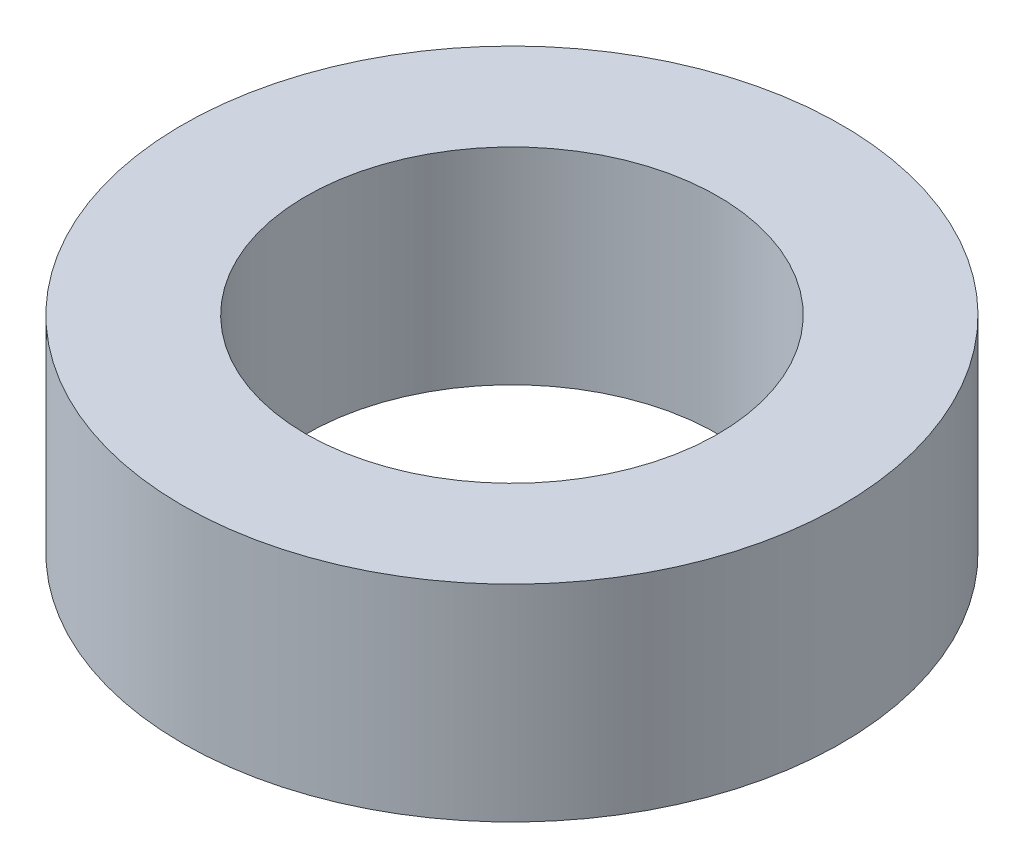
ISO-10303-21;
HEADER;
FILE_DESCRIPTION(('STEP AP214'),'2;1');
FILE_NAME('part.step','',(''),(''),'','','');
FILE_SCHEMA(('AUTOMOTIVE_DESIGN { 1 0 10303 214 1 1 1 1 }'));
ENDSEC;
DATA;
#1=APPLICATION_CONTEXT('core data for automotive mechanical design processes');
#2=APPLICATION_PROTOCOL_DEFINITION('international standard','automotive_design',2000,#1);
#3=PRODUCT_CONTEXT('',#1,'mechanical');
#4=PRODUCT('Part','Part','',(#3));
#5=PRODUCT_RELATED_PRODUCT_CATEGORY('part','',(#4));
#6=PRODUCT_DEFINITION_FORMATION('','',#4);
#7=PRODUCT_DEFINITION_CONTEXT('part definition',#1,'design');
#8=PRODUCT_DEFINITION('design','',#6,#7);
#9=PRODUCT_DEFINITION_SHAPE('','',#8);
#10=(LENGTH_UNIT() NAMED_UNIT(*) SI_UNIT(.MILLI.,.METRE.));
#11=(NAMED_UNIT(*) PLANE_ANGLE_UNIT() SI_UNIT($,.RADIAN.));
#12=(NAMED_UNIT(*) SI_UNIT($,.STERADIAN.) SOLID_ANGLE_UNIT());
#13=UNCERTAINTY_MEASURE_WITH_UNIT(LENGTH_MEASURE(1.E-05),#10,'distance_accuracy_value','');
#14=(GEOMETRIC_REPRESENTATION_CONTEXT(3) GLOBAL_UNCERTAINTY_ASSIGNED_CONTEXT((#13)) GLOBAL_UNIT_ASSIGNED_CONTEXT((#10,
#11,#12)) REPRESENTATION_CONTEXT('',''));
#15=CARTESIAN_POINT('',(0.,0.,0.));
#16=DIRECTION('',(0.,0.,1.));
#17=DIRECTION('',(1.,0.,0.));
#18=AXIS2_PLACEMENT_3D('',#15,#16,#17);
#19=CARTESIAN_POINT('',(0.,1.25,0.));
#20=DIRECTION('',(0.,1.,0.));
#21=DIRECTION('',(0.,0.,1.));
#22=AXIS2_PLACEMENT_3D('',#19,#20,#21);
#23=PLANE('',#22);
#24=CARTESIAN_POINT('',(0.,1.25,0.));
#25=DIRECTION('',(0.,1.,0.));
#26=DIRECTION('',(0.,0.,1.));
#27=AXIS2_PLACEMENT_3D('',#24,#25,#26);
#28=CIRCLE('',#27,4.);
#29=CARTESIAN_POINT('',(0.,1.25,4.));
#30=VERTEX_POINT('',#29);
#31=EDGE_CURVE('E10',#30,#30,#28,.T.);
#32=ORIENTED_EDGE('',*,*,#31,.T.);
#33=EDGE_LOOP('',(#32));
#34=FACE_BOUND('',#33,.T.);
#35=CARTESIAN_POINT('',(0.,1.25,0.));
#36=DIRECTION('',(0.,1.,0.));
#37=DIRECTION('',(0.,0.,1.));
#38=AXIS2_PLACEMENT_3D('',#35,#36,#37);
#39=CIRCLE('',#38,2.5);
#40=CARTESIAN_POINT('',(0.,1.25,2.5));
#41=VERTEX_POINT('',#40);
#42=EDGE_CURVE('E50',#41,#41,#39,.T.);
#43=ORIENTED_EDGE('',*,*,#42,.F.);
#44=EDGE_LOOP('',(#43));
#45=FACE_BOUND('',#44,.T.);
#46=ADVANCED_FACE('F39',(#34,#45),#23,.T.);
#47=CARTESIAN_POINT('',(0.,-1.25,0.));
#48=DIRECTION('',(0.,1.,0.));
#49=DIRECTION('',(0.,0.,1.));
#50=AXIS2_PLACEMENT_3D('',#47,#48,#49);
#51=PLANE('',#50);
#52=CARTESIAN_POINT('',(0.,-1.25,0.));
#53=DIRECTION('',(0.,1.,0.));
#54=DIRECTION('',(0.,0.,1.));
#55=AXIS2_PLACEMENT_3D('',#52,#53,#54);
#56=CIRCLE('',#55,4.);
#57=CARTESIAN_POINT('',(0.,-1.25,4.));
#58=VERTEX_POINT('',#57);
#59=EDGE_CURVE('E43',#58,#58,#56,.T.);
#60=ORIENTED_EDGE('',*,*,#59,.F.);
#61=EDGE_LOOP('',(#60));
#62=FACE_BOUND('',#61,.T.);
#63=CARTESIAN_POINT('',(0.,-1.25,0.));
#64=DIRECTION('',(0.,1.,0.));
#65=DIRECTION('',(0.,0.,1.));
#66=AXIS2_PLACEMENT_3D('',#63,#64,#65);
#67=CIRCLE('',#66,2.5);
#68=CARTESIAN_POINT('',(0.,-1.25,2.5));
#69=VERTEX_POINT('',#68);
#70=EDGE_CURVE('E52',#69,#69,#67,.T.);
#71=ORIENTED_EDGE('',*,*,#70,.T.);
#72=EDGE_LOOP('',(#71));
#73=FACE_BOUND('',#72,.T.);
#74=ADVANCED_FACE('F62',(#62,#73),#51,.F.);
#75=CARTESIAN_POINT('',(0.,1.25,0.));
#76=DIRECTION('',(0.,-1.,0.));
#77=DIRECTION('',(0.,0.,-1.));
#78=AXIS2_PLACEMENT_3D('',#75,#76,#77);
#79=CYLINDRICAL_SURFACE('',#78,4.);
#80=ORIENTED_EDGE('',*,*,#31,.F.);
#81=EDGE_LOOP('',(#80));
#82=FACE_BOUND('',#81,.T.);
#83=ORIENTED_EDGE('',*,*,#59,.T.);
#84=EDGE_LOOP('',(#83));
#85=FACE_BOUND('',#84,.T.);
#86=ADVANCED_FACE('F41',(#82,#85),#79,.T.);
#87=CARTESIAN_POINT('',(0.,1.25,0.));
#88=DIRECTION('',(0.,-1.,0.));
#89=DIRECTION('',(0.,0.,-1.));
#90=AXIS2_PLACEMENT_3D('',#87,#88,#89);
#91=CYLINDRICAL_SURFACE('',#90,2.5);
#92=ORIENTED_EDGE('',*,*,#42,.T.);
#93=EDGE_LOOP('',(#92));
#94=FACE_BOUND('',#93,.T.);
#95=ORIENTED_EDGE('',*,*,#70,.F.);
#96=EDGE_LOOP('',(#95));
#97=FACE_BOUND('',#96,.T.);
#98=ADVANCED_FACE('F58',(#94,#97),#91,.F.);
#99=CLOSED_SHELL('',(#46,#74,#86,#98));
#100=MANIFOLD_SOLID_BREP('B2',#99);
#101=ADVANCED_BREP_SHAPE_REPRESENTATION('',(#18,#100),#14);
#102=SHAPE_DEFINITION_REPRESENTATION(#9,#101);
ENDSEC;
END-ISO-10303-21;
